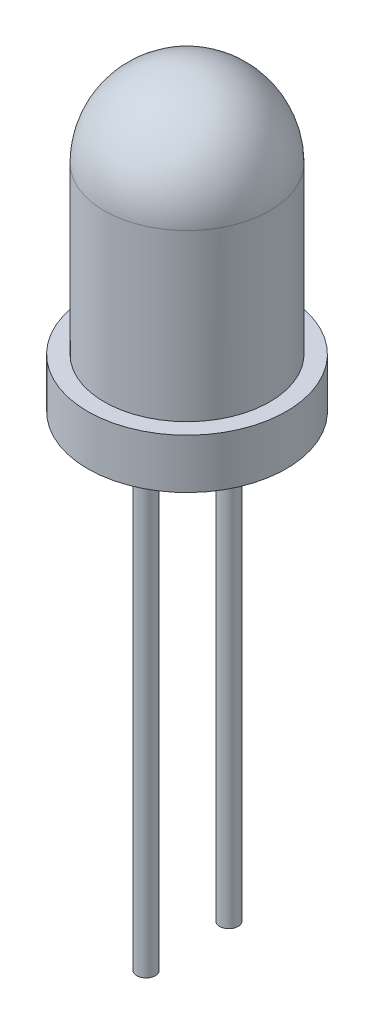
ISO-10303-21;
HEADER;
FILE_DESCRIPTION(('STEP AP214'),'2;1');
FILE_NAME('part.step','',(''),(''),'','','');
FILE_SCHEMA(('AUTOMOTIVE_DESIGN { 1 0 10303 214 1 1 1 1 }'));
ENDSEC;
DATA;
#1=APPLICATION_CONTEXT('core data for automotive mechanical design processes');
#2=APPLICATION_PROTOCOL_DEFINITION('international standard','automotive_design',2000,#1);
#3=PRODUCT_CONTEXT('',#1,'mechanical');
#4=PRODUCT('Part','Part','',(#3));
#5=PRODUCT_RELATED_PRODUCT_CATEGORY('part','',(#4));
#6=PRODUCT_DEFINITION_FORMATION('','',#4);
#7=PRODUCT_DEFINITION_CONTEXT('part definition',#1,'design');
#8=PRODUCT_DEFINITION('design','',#6,#7);
#9=PRODUCT_DEFINITION_SHAPE('','',#8);
#10=(LENGTH_UNIT() NAMED_UNIT(*) SI_UNIT(.MILLI.,.METRE.));
#11=(NAMED_UNIT(*) PLANE_ANGLE_UNIT() SI_UNIT($,.RADIAN.));
#12=(NAMED_UNIT(*) SI_UNIT($,.STERADIAN.) SOLID_ANGLE_UNIT());
#13=UNCERTAINTY_MEASURE_WITH_UNIT(LENGTH_MEASURE(1.E-05),#10,'distance_accuracy_value','');
#14=(GEOMETRIC_REPRESENTATION_CONTEXT(3) GLOBAL_UNCERTAINTY_ASSIGNED_CONTEXT((#13)) GLOBAL_UNIT_ASSIGNED_CONTEXT((#10,
#11,#12)) REPRESENTATION_CONTEXT('',''));
#15=CARTESIAN_POINT('',(0.,0.,0.));
#16=DIRECTION('',(0.,0.,1.));
#17=DIRECTION('',(1.,0.,0.));
#18=AXIS2_PLACEMENT_3D('',#15,#16,#17);
#19=CARTESIAN_POINT('',(-1.51810561215308,-0.0183654624054341,0.254));
#20=DIRECTION('',(0.,1.,0.));
#21=DIRECTION('',(0.,0.,1.));
#22=AXIS2_PLACEMENT_3D('',#19,#20,#21);
#23=PLANE('',#22);
#24=DIRECTION('',(0.,0.,-1.));
#25=VECTOR('',#24,1.);
#26=CARTESIAN_POINT('',(-1.51810561215308,-0.0183654624054341,0.254));
#27=LINE('',#26,#25);
#28=CARTESIAN_POINT('',(-1.51810561215308,-0.0183654624054341,0.254));
#29=VERTEX_POINT('',#28);
#30=CARTESIAN_POINT('',(-1.51810561215308,-0.0183654624054341,-0.254));
#31=VERTEX_POINT('',#30);
#32=EDGE_CURVE('E107',#29,#31,#27,.T.);
#33=ORIENTED_EDGE('',*,*,#32,.T.);
#34=DIRECTION('',(1.,0.,0.));
#35=VECTOR('',#34,1.);
#36=CARTESIAN_POINT('',(-1.51810561215308,-0.0183654624054341,-0.254));
#37=LINE('',#36,#35);
#38=CARTESIAN_POINT('',(-0.972005612152632,-0.0183654624054341,-0.254));
#39=VERTEX_POINT('',#38);
#40=EDGE_CURVE('E101',#31,#39,#37,.T.);
#41=ORIENTED_EDGE('',*,*,#40,.T.);
#42=DIRECTION('',(0.,0.,-1.));
#43=VECTOR('',#42,1.);
#44=CARTESIAN_POINT('',(-0.972005612152632,-0.0183654624054341,0.254));
#45=LINE('',#44,#43);
#46=CARTESIAN_POINT('',(-0.972005612152632,-0.0183654624054341,0.254));
#47=VERTEX_POINT('',#46);
#48=EDGE_CURVE('E12',#47,#39,#45,.T.);
#49=ORIENTED_EDGE('',*,*,#48,.F.);
#50=DIRECTION('',(1.,0.,0.));
#51=VECTOR('',#50,1.);
#52=CARTESIAN_POINT('',(-1.51810561215308,-0.0183654624054341,0.254));
#53=LINE('',#52,#51);
#54=EDGE_CURVE('E116',#29,#47,#53,.T.);
#55=ORIENTED_EDGE('',*,*,#54,.F.);
#56=EDGE_LOOP('',(#33,#41,#49,#55));
#57=FACE_BOUND('',#56,.T.);
#58=ADVANCED_FACE('F43',(#57),#23,.F.);
#59=CARTESIAN_POINT('',(-0.972005612152632,-0.0183654624054341,0.254));
#60=DIRECTION('',(-1.,0.,0.));
#61=DIRECTION('',(0.,-1.,0.));
#62=AXIS2_PLACEMENT_3D('',#59,#60,#61);
#63=PLANE('',#62);
#64=ORIENTED_EDGE('',*,*,#48,.T.);
#65=DIRECTION('',(0.,1.,0.));
#66=VECTOR('',#65,1.);
#67=CARTESIAN_POINT('',(-0.972005612152632,-0.0183654624054341,-0.254));
#68=LINE('',#67,#66);
#69=CARTESIAN_POINT('',(-0.97200561215264,2.52163453759334,-0.254));
#70=VERTEX_POINT('',#69);
#71=EDGE_CURVE('E91',#39,#70,#68,.T.);
#72=ORIENTED_EDGE('',*,*,#71,.T.);
#73=DIRECTION('',(0.,0.,-1.));
#74=VECTOR('',#73,1.);
#75=CARTESIAN_POINT('',(-0.97200561215264,2.52163453759334,0.254));
#76=LINE('',#75,#74);
#77=CARTESIAN_POINT('',(-0.97200561215264,2.52163453759334,0.254));
#78=VERTEX_POINT('',#77);
#79=EDGE_CURVE('E50',#78,#70,#76,.T.);
#80=ORIENTED_EDGE('',*,*,#79,.F.);
#81=DIRECTION('',(0.,1.,0.));
#82=VECTOR('',#81,1.);
#83=CARTESIAN_POINT('',(-0.972005612152632,-0.0183654624054341,0.254));
#84=LINE('',#83,#82);
#85=EDGE_CURVE('E92',#47,#78,#84,.T.);
#86=ORIENTED_EDGE('',*,*,#85,.F.);
#87=EDGE_LOOP('',(#64,#72,#80,#86));
#88=FACE_BOUND('',#87,.T.);
#89=ADVANCED_FACE('F89',(#88),#63,.F.);
#90=CARTESIAN_POINT('',(-1.24505561215268,4.04563453759452,0.254));
#91=DIRECTION('',(-0.984326018472931,-0.176358411642956,0.));
#92=DIRECTION('',(0.176358411642956,-0.984326018472931,0.));
#93=AXIS2_PLACEMENT_3D('',#90,#91,#92);
#94=PLANE('',#93);
#95=ORIENTED_EDGE('',*,*,#79,.T.);
#96=DIRECTION('',(-0.176358411642956,0.984326018472931,0.));
#97=VECTOR('',#96,1.);
#98=CARTESIAN_POINT('',(-1.24505561215268,4.04563453759452,-0.254));
#99=LINE('',#98,#97);
#100=CARTESIAN_POINT('',(-1.24505561215268,4.04563453759452,-0.254));
#101=VERTEX_POINT('',#100);
#102=EDGE_CURVE('E105',#70,#101,#99,.T.);
#103=ORIENTED_EDGE('',*,*,#102,.T.);
#104=DIRECTION('',(0.,0.,-1.));
#105=VECTOR('',#104,1.);
#106=CARTESIAN_POINT('',(-1.24505561215268,4.04563453759452,0.254));
#107=LINE('',#106,#105);
#108=CARTESIAN_POINT('',(-1.24505561215268,4.04563453759452,0.254));
#109=VERTEX_POINT('',#108);
#110=EDGE_CURVE('E126',#109,#101,#107,.T.);
#111=ORIENTED_EDGE('',*,*,#110,.F.);
#112=DIRECTION('',(-0.176358411642956,0.984326018472931,0.));
#113=VECTOR('',#112,1.);
#114=CARTESIAN_POINT('',(-1.24505561215268,4.04563453759452,0.254));
#115=LINE('',#114,#113);
#116=EDGE_CURVE('E119',#78,#109,#115,.T.);
#117=ORIENTED_EDGE('',*,*,#116,.F.);
#118=EDGE_LOOP('',(#95,#103,#111,#117));
#119=FACE_BOUND('',#118,.T.);
#120=ADVANCED_FACE('F129',(#119),#94,.F.);
#121=CARTESIAN_POINT('',(-1.24505561215268,4.04563453759452,0.254));
#122=DIRECTION('',(-1.6518150659341E-13,-1.,0.));
#123=DIRECTION('',(1.,-1.6518150659341E-13,0.));
#124=AXIS2_PLACEMENT_3D('',#121,#122,#123);
#125=PLANE('',#124);
#126=ORIENTED_EDGE('',*,*,#110,.T.);
#127=DIRECTION('',(-1.,1.6518150659341E-13,0.));
#128=VECTOR('',#127,1.);
#129=CARTESIAN_POINT('',(-1.24505561215268,4.04563453759452,-0.254));
#130=LINE('',#129,#128);
#131=CARTESIAN_POINT('',(-1.51810561215308,4.04563453759457,-0.254));
#132=VERTEX_POINT('',#131);
#133=EDGE_CURVE('E111',#101,#132,#130,.T.);
#134=ORIENTED_EDGE('',*,*,#133,.T.);
#135=DIRECTION('',(0.,0.,-1.));
#136=VECTOR('',#135,1.);
#137=CARTESIAN_POINT('',(-1.51810561215308,4.04563453759457,0.254));
#138=LINE('',#137,#136);
#139=CARTESIAN_POINT('',(-1.51810561215308,4.04563453759457,0.254));
#140=VERTEX_POINT('',#139);
#141=EDGE_CURVE('E124',#140,#132,#138,.T.);
#142=ORIENTED_EDGE('',*,*,#141,.F.);
#143=DIRECTION('',(-1.,1.6518150659341E-13,0.));
#144=VECTOR('',#143,1.);
#145=CARTESIAN_POINT('',(-1.24505561215268,4.04563453759452,0.254));
#146=LINE('',#145,#144);
#147=EDGE_CURVE('E62',#109,#140,#146,.T.);
#148=ORIENTED_EDGE('',*,*,#147,.F.);
#149=EDGE_LOOP('',(#126,#134,#142,#148));
#150=FACE_BOUND('',#149,.T.);
#151=ADVANCED_FACE('F140',(#150),#125,.F.);
#152=CARTESIAN_POINT('',(-1.51810561215308,-0.0183654624054341,0.254));
#153=DIRECTION('',(1.,0.,0.));
#154=DIRECTION('',(0.,0.,-1.));
#155=AXIS2_PLACEMENT_3D('',#152,#153,#154);
#156=PLANE('',#155);
#157=ORIENTED_EDGE('',*,*,#141,.T.);
#158=DIRECTION('',(0.,-1.,0.));
#159=VECTOR('',#158,1.);
#160=CARTESIAN_POINT('',(-1.51810561215308,-0.0183654624054341,-0.254));
#161=LINE('',#160,#159);
#162=EDGE_CURVE('E114',#132,#31,#161,.T.);
#163=ORIENTED_EDGE('',*,*,#162,.T.);
#164=ORIENTED_EDGE('',*,*,#32,.F.);
#165=DIRECTION('',(0.,-1.,0.));
#166=VECTOR('',#165,1.);
#167=CARTESIAN_POINT('',(-1.51810561215308,-0.0183654624054341,0.254));
#168=LINE('',#167,#166);
#169=EDGE_CURVE('E57',#140,#29,#168,.T.);
#170=ORIENTED_EDGE('',*,*,#169,.F.);
#171=EDGE_LOOP('',(#157,#163,#164,#170));
#172=FACE_BOUND('',#171,.T.);
#173=ADVANCED_FACE('F133',(#172),#156,.F.);
#174=CARTESIAN_POINT('',(-1.51810561215308,-0.0183654624054341,0.254));
#175=DIRECTION('',(0.,0.,1.));
#176=DIRECTION('',(1.,0.,0.));
#177=AXIS2_PLACEMENT_3D('',#174,#175,#176);
#178=PLANE('',#177);
#179=ORIENTED_EDGE('',*,*,#54,.T.);
#180=ORIENTED_EDGE('',*,*,#85,.T.);
#181=ORIENTED_EDGE('',*,*,#116,.T.);
#182=ORIENTED_EDGE('',*,*,#147,.T.);
#183=ORIENTED_EDGE('',*,*,#169,.T.);
#184=EDGE_LOOP('',(#179,#180,#181,#182,#183));
#185=FACE_BOUND('',#184,.T.);
#186=ADVANCED_FACE('F131',(#185),#178,.T.);
#187=CARTESIAN_POINT('',(-1.51810561215308,-0.0183654624054341,-0.254));
#188=DIRECTION('',(0.,0.,1.));
#189=DIRECTION('',(1.,0.,0.));
#190=AXIS2_PLACEMENT_3D('',#187,#188,#189);
#191=PLANE('',#190);
#192=ORIENTED_EDGE('',*,*,#40,.F.);
#193=ORIENTED_EDGE('',*,*,#162,.F.);
#194=ORIENTED_EDGE('',*,*,#133,.F.);
#195=ORIENTED_EDGE('',*,*,#102,.F.);
#196=ORIENTED_EDGE('',*,*,#71,.F.);
#197=EDGE_LOOP('',(#192,#193,#194,#195,#196));
#198=FACE_BOUND('',#197,.T.);
#199=ADVANCED_FACE('F99',(#198),#191,.F.);
#200=CLOSED_SHELL('',(#58,#89,#120,#151,#173,#186,#199));
#201=MANIFOLD_SOLID_BREP('B2',#200);
#202=CARTESIAN_POINT('',(0.983794387847156,-0.0183654624053667,0.254));
#203=DIRECTION('',(0.,1.,0.));
#204=DIRECTION('',(0.,0.,1.));
#205=AXIS2_PLACEMENT_3D('',#202,#203,#204);
#206=PLANE('',#205);
#207=DIRECTION('',(0.,0.,-1.));
#208=VECTOR('',#207,1.);
#209=CARTESIAN_POINT('',(0.983794387847156,-0.0183654624053667,0.254));
#210=LINE('',#209,#208);
#211=CARTESIAN_POINT('',(0.983794387847156,-0.0183654624053667,0.254));
#212=VERTEX_POINT('',#211);
#213=CARTESIAN_POINT('',(0.983794387847156,-0.0183654624053667,-0.254));
#214=VERTEX_POINT('',#213);
#215=EDGE_CURVE('E281',#212,#214,#210,.T.);
#216=ORIENTED_EDGE('',*,*,#215,.T.);
#217=DIRECTION('',(1.,0.,0.));
#218=VECTOR('',#217,1.);
#219=CARTESIAN_POINT('',(0.983794387847156,-0.0183654624053667,-0.254));
#220=LINE('',#219,#218);
#221=CARTESIAN_POINT('',(1.52989438784706,-0.0183654624053667,-0.254));
#222=VERTEX_POINT('',#221);
#223=EDGE_CURVE('E275',#214,#222,#220,.T.);
#224=ORIENTED_EDGE('',*,*,#223,.T.);
#225=DIRECTION('',(0.,0.,-1.));
#226=VECTOR('',#225,1.);
#227=CARTESIAN_POINT('',(1.52989438784706,-0.0183654624053667,0.254));
#228=LINE('',#227,#226);
#229=CARTESIAN_POINT('',(1.52989438784706,-0.0183654624053667,0.254));
#230=VERTEX_POINT('',#229);
#231=EDGE_CURVE('E41',#230,#222,#228,.T.);
#232=ORIENTED_EDGE('',*,*,#231,.F.);
#233=DIRECTION('',(1.,0.,0.));
#234=VECTOR('',#233,1.);
#235=CARTESIAN_POINT('',(0.983794387847156,-0.0183654624053667,0.254));
#236=LINE('',#235,#234);
#237=EDGE_CURVE('E299',#212,#230,#236,.T.);
#238=ORIENTED_EDGE('',*,*,#237,.F.);
#239=EDGE_LOOP('',(#216,#224,#232,#238));
#240=FACE_BOUND('',#239,.T.);
#241=ADVANCED_FACE('F199',(#240),#206,.F.);
#242=CARTESIAN_POINT('',(1.52989438784706,-0.0183654624053667,0.254));
#243=DIRECTION('',(-1.,0.,0.));
#244=DIRECTION('',(0.,-1.,0.));
#245=AXIS2_PLACEMENT_3D('',#242,#243,#244);
#246=PLANE('',#245);
#247=ORIENTED_EDGE('',*,*,#231,.T.);
#248=DIRECTION('',(0.,1.,0.));
#249=VECTOR('',#248,1.);
#250=CARTESIAN_POINT('',(1.52989438784706,-0.0183654624053667,-0.254));
#251=LINE('',#250,#249);
#252=CARTESIAN_POINT('',(1.52989438784706,3.79163453759448,-0.254));
#253=VERTEX_POINT('',#252);
#254=EDGE_CURVE('E265',#222,#253,#251,.T.);
#255=ORIENTED_EDGE('',*,*,#254,.T.);
#256=DIRECTION('',(0.,0.,-1.));
#257=VECTOR('',#256,1.);
#258=CARTESIAN_POINT('',(1.52989438784706,3.79163453759448,0.254));
#259=LINE('',#258,#257);
#260=CARTESIAN_POINT('',(1.52989438784706,3.79163453759448,0.254));
#261=VERTEX_POINT('',#260);
#262=EDGE_CURVE('E206',#261,#253,#259,.T.);
#263=ORIENTED_EDGE('',*,*,#262,.F.);
#264=DIRECTION('',(0.,1.,0.));
#265=VECTOR('',#264,1.);
#266=CARTESIAN_POINT('',(1.52989438784706,-0.0183654624053667,0.254));
#267=LINE('',#266,#265);
#268=EDGE_CURVE('E266',#230,#261,#267,.T.);
#269=ORIENTED_EDGE('',*,*,#268,.F.);
#270=EDGE_LOOP('',(#247,#255,#263,#269));
#271=FACE_BOUND('',#270,.T.);
#272=ADVANCED_FACE('F263',(#271),#246,.F.);
#273=CARTESIAN_POINT('',(1.27589438784708,3.79163453759448,0.254));
#274=DIRECTION('',(0.,0.,-1.));
#275=DIRECTION('',(-1.,0.,0.));
#276=AXIS2_PLACEMENT_3D('',#273,#274,#275);
#277=CYLINDRICAL_SURFACE('',#276,0.253999999999972);
#278=ORIENTED_EDGE('',*,*,#262,.T.);
#279=CARTESIAN_POINT('',(1.27589438784708,3.79163453759448,-0.254));
#280=DIRECTION('',(0.,0.,1.));
#281=DIRECTION('',(1.,0.,0.));
#282=AXIS2_PLACEMENT_3D('',#279,#280,#281);
#283=CIRCLE('',#282,0.253999999999972);
#284=CARTESIAN_POINT('',(1.27589438784708,4.04563453759448,-0.254));
#285=VERTEX_POINT('',#284);
#286=EDGE_CURVE('E279',#253,#285,#283,.T.);
#287=ORIENTED_EDGE('',*,*,#286,.T.);
#288=DIRECTION('',(0.,0.,-1.));
#289=VECTOR('',#288,1.);
#290=CARTESIAN_POINT('',(1.27589438784708,4.04563453759448,0.254));
#291=LINE('',#290,#289);
#292=CARTESIAN_POINT('',(1.27589438784708,4.04563453759448,0.254));
#293=VERTEX_POINT('',#292);
#294=EDGE_CURVE('E321',#293,#285,#291,.T.);
#295=ORIENTED_EDGE('',*,*,#294,.F.);
#296=CARTESIAN_POINT('',(1.27589438784708,3.79163453759448,0.254));
#297=DIRECTION('',(0.,0.,1.));
#298=DIRECTION('',(1.,0.,0.));
#299=AXIS2_PLACEMENT_3D('',#296,#297,#298);
#300=CIRCLE('',#299,0.253999999999972);
#301=EDGE_CURVE('E302',#261,#293,#300,.T.);
#302=ORIENTED_EDGE('',*,*,#301,.F.);
#303=EDGE_LOOP('',(#278,#287,#295,#302));
#304=FACE_BOUND('',#303,.T.);
#305=ADVANCED_FACE('F324',(#304),#277,.T.);
#306=CARTESIAN_POINT('',(1.27589438784708,4.04563453759448,0.254));
#307=DIRECTION('',(0.,-1.,0.));
#308=DIRECTION('',(0.,0.,-1.));
#309=AXIS2_PLACEMENT_3D('',#306,#307,#308);
#310=PLANE('',#309);
#311=ORIENTED_EDGE('',*,*,#294,.T.);
#312=DIRECTION('',(-1.,0.,0.));
#313=VECTOR('',#312,1.);
#314=CARTESIAN_POINT('',(1.27589438784708,4.04563453759448,-0.254));
#315=LINE('',#314,#313);
#316=CARTESIAN_POINT('',(-0.737055612152962,4.04563453759448,-0.254));
#317=VERTEX_POINT('',#316);
#318=EDGE_CURVE('E285',#285,#317,#315,.T.);
#319=ORIENTED_EDGE('',*,*,#318,.T.);
#320=DIRECTION('',(0.,0.,-1.));
#321=VECTOR('',#320,1.);
#322=CARTESIAN_POINT('',(-0.737055612152962,4.04563453759448,0.254));
#323=LINE('',#322,#321);
#324=CARTESIAN_POINT('',(-0.737055612152962,4.04563453759448,0.254));
#325=VERTEX_POINT('',#324);
#326=EDGE_CURVE('E319',#325,#317,#323,.T.);
#327=ORIENTED_EDGE('',*,*,#326,.F.);
#328=DIRECTION('',(-1.,0.,0.));
#329=VECTOR('',#328,1.);
#330=CARTESIAN_POINT('',(1.27589438784708,4.04563453759448,0.254));
#331=LINE('',#330,#329);
#332=EDGE_CURVE('E304',#293,#325,#331,.T.);
#333=ORIENTED_EDGE('',*,*,#332,.F.);
#334=EDGE_LOOP('',(#311,#319,#327,#333));
#335=FACE_BOUND('',#334,.T.);
#336=ADVANCED_FACE('F332',(#335),#310,.F.);
#337=CARTESIAN_POINT('',(-0.737055612152962,4.04563453759448,0.254));
#338=DIRECTION('',(0.984326018472887,0.176358411643205,0.));
#339=DIRECTION('',(-0.176358411643205,0.984326018472887,0.));
#340=AXIS2_PLACEMENT_3D('',#337,#338,#339);
#341=PLANE('',#340);
#342=ORIENTED_EDGE('',*,*,#326,.T.);
#343=DIRECTION('',(0.176358411643205,-0.984326018472887,0.));
#344=VECTOR('',#343,1.);
#345=CARTESIAN_POINT('',(-0.737055612152962,4.04563453759448,-0.254));
#346=LINE('',#345,#344);
#347=CARTESIAN_POINT('',(-0.464005612152741,2.52163453759451,-0.254));
#348=VERTEX_POINT('',#347);
#349=EDGE_CURVE('E288',#317,#348,#346,.T.);
#350=ORIENTED_EDGE('',*,*,#349,.T.);
#351=DIRECTION('',(0.,0.,-1.));
#352=VECTOR('',#351,1.);
#353=CARTESIAN_POINT('',(-0.464005612152741,2.52163453759451,0.254));
#354=LINE('',#353,#352);
#355=CARTESIAN_POINT('',(-0.464005612152741,2.52163453759451,0.254));
#356=VERTEX_POINT('',#355);
#357=EDGE_CURVE('E317',#356,#348,#354,.T.);
#358=ORIENTED_EDGE('',*,*,#357,.F.);
#359=DIRECTION('',(0.176358411643205,-0.984326018472887,0.));
#360=VECTOR('',#359,1.);
#361=CARTESIAN_POINT('',(-0.737055612152962,4.04563453759448,0.254));
#362=LINE('',#361,#360);
#363=EDGE_CURVE('E306',#325,#356,#362,.T.);
#364=ORIENTED_EDGE('',*,*,#363,.F.);
#365=EDGE_LOOP('',(#342,#350,#358,#364));
#366=FACE_BOUND('',#365,.T.);
#367=ADVANCED_FACE('F335',(#366),#341,.F.);
#368=CARTESIAN_POINT('',(0.729794387847184,2.52163453759447,0.254));
#369=DIRECTION('',(0.,1.,0.));
#370=DIRECTION('',(0.,0.,1.));
#371=AXIS2_PLACEMENT_3D('',#368,#369,#370);
#372=PLANE('',#371);
#373=ORIENTED_EDGE('',*,*,#357,.T.);
#374=DIRECTION('',(1.,0.,0.));
#375=VECTOR('',#374,1.);
#376=CARTESIAN_POINT('',(0.475794387847054,2.52163453759447,-0.254));
#377=LINE('',#376,#375);
#378=CARTESIAN_POINT('',(0.729794387847184,2.52163453759449,-0.254));
#379=VERTEX_POINT('',#378);
#380=EDGE_CURVE('E291',#348,#379,#377,.T.);
#381=ORIENTED_EDGE('',*,*,#380,.T.);
#382=DIRECTION('',(0.,0.,-1.));
#383=VECTOR('',#382,1.);
#384=CARTESIAN_POINT('',(0.729794387847184,2.52163453759449,0.254));
#385=LINE('',#384,#383);
#386=CARTESIAN_POINT('',(0.729794387847184,2.52163453759449,0.254));
#387=VERTEX_POINT('',#386);
#388=EDGE_CURVE('E315',#387,#379,#385,.T.);
#389=ORIENTED_EDGE('',*,*,#388,.F.);
#390=DIRECTION('',(1.,0.,0.));
#391=VECTOR('',#390,1.);
#392=CARTESIAN_POINT('',(0.475794387847054,2.52163453759447,0.254));
#393=LINE('',#392,#391);
#394=EDGE_CURVE('E308',#356,#387,#393,.T.);
#395=ORIENTED_EDGE('',*,*,#394,.F.);
#396=EDGE_LOOP('',(#373,#381,#389,#395));
#397=FACE_BOUND('',#396,.T.);
#398=ADVANCED_FACE('F340',(#397),#372,.F.);
#399=CARTESIAN_POINT('',(0.729794387847184,2.26763453759454,0.254));
#400=DIRECTION('',(0.,0.,-1.));
#401=DIRECTION('',(-1.,0.,0.));
#402=AXIS2_PLACEMENT_3D('',#399,#400,#401);
#403=CYLINDRICAL_SURFACE('',#402,0.253999999999949);
#404=ORIENTED_EDGE('',*,*,#388,.T.);
#405=CARTESIAN_POINT('',(0.729794387847184,2.26763453759454,-0.254));
#406=DIRECTION('',(0.,0.,-1.));
#407=DIRECTION('',(1.,0.,0.));
#408=AXIS2_PLACEMENT_3D('',#405,#406,#407);
#409=CIRCLE('',#408,0.253999999999949);
#410=CARTESIAN_POINT('',(0.983794387847156,2.26763453759454,-0.254));
#411=VERTEX_POINT('',#410);
#412=EDGE_CURVE('E294',#379,#411,#409,.T.);
#413=ORIENTED_EDGE('',*,*,#412,.T.);
#414=DIRECTION('',(0.,0.,-1.));
#415=VECTOR('',#414,1.);
#416=CARTESIAN_POINT('',(0.983794387847156,2.26763453759454,0.254));
#417=LINE('',#416,#415);
#418=CARTESIAN_POINT('',(0.983794387847156,2.26763453759454,0.254));
#419=VERTEX_POINT('',#418);
#420=EDGE_CURVE('E313',#419,#411,#417,.T.);
#421=ORIENTED_EDGE('',*,*,#420,.F.);
#422=CARTESIAN_POINT('',(0.729794387847184,2.26763453759454,0.254));
#423=DIRECTION('',(0.,0.,-1.));
#424=DIRECTION('',(1.,0.,0.));
#425=AXIS2_PLACEMENT_3D('',#422,#423,#424);
#426=CIRCLE('',#425,0.253999999999949);
#427=EDGE_CURVE('E218',#387,#419,#426,.T.);
#428=ORIENTED_EDGE('',*,*,#427,.F.);
#429=EDGE_LOOP('',(#404,#413,#421,#428));
#430=FACE_BOUND('',#429,.T.);
#431=ADVANCED_FACE('F343',(#430),#403,.F.);
#432=CARTESIAN_POINT('',(0.983794387847156,-0.0183654624053667,0.254));
#433=DIRECTION('',(1.,0.,0.));
#434=DIRECTION('',(0.,0.,-1.));
#435=AXIS2_PLACEMENT_3D('',#432,#433,#434);
#436=PLANE('',#435);
#437=ORIENTED_EDGE('',*,*,#420,.T.);
#438=DIRECTION('',(0.,-1.,0.));
#439=VECTOR('',#438,1.);
#440=CARTESIAN_POINT('',(0.983794387847156,-0.0183654624053667,-0.254));
#441=LINE('',#440,#439);
#442=EDGE_CURVE('E297',#411,#214,#441,.T.);
#443=ORIENTED_EDGE('',*,*,#442,.T.);
#444=ORIENTED_EDGE('',*,*,#215,.F.);
#445=DIRECTION('',(0.,-1.,0.));
#446=VECTOR('',#445,1.);
#447=CARTESIAN_POINT('',(0.983794387847156,-0.0183654624053667,0.254));
#448=LINE('',#447,#446);
#449=EDGE_CURVE('E213',#419,#212,#448,.T.);
#450=ORIENTED_EDGE('',*,*,#449,.F.);
#451=EDGE_LOOP('',(#437,#443,#444,#450));
#452=FACE_BOUND('',#451,.T.);
#453=ADVANCED_FACE('F345',(#452),#436,.F.);
#454=CARTESIAN_POINT('',(1.27589438784708,3.79163453759448,0.254));
#455=DIRECTION('',(0.,0.,1.));
#456=DIRECTION('',(1.,0.,0.));
#457=AXIS2_PLACEMENT_3D('',#454,#455,#456);
#458=PLANE('',#457);
#459=ORIENTED_EDGE('',*,*,#237,.T.);
#460=ORIENTED_EDGE('',*,*,#268,.T.);
#461=ORIENTED_EDGE('',*,*,#301,.T.);
#462=ORIENTED_EDGE('',*,*,#332,.T.);
#463=ORIENTED_EDGE('',*,*,#363,.T.);
#464=ORIENTED_EDGE('',*,*,#394,.T.);
#465=ORIENTED_EDGE('',*,*,#427,.T.);
#466=ORIENTED_EDGE('',*,*,#449,.T.);
#467=EDGE_LOOP('',(#459,#460,#461,#462,#463,#464,#465,#466));
#468=FACE_BOUND('',#467,.T.);
#469=ADVANCED_FACE('F327',(#468),#458,.T.);
#470=CARTESIAN_POINT('',(1.27589438784708,3.79163453759448,-0.254));
#471=DIRECTION('',(0.,0.,1.));
#472=DIRECTION('',(1.,0.,0.));
#473=AXIS2_PLACEMENT_3D('',#470,#471,#472);
#474=PLANE('',#473);
#475=ORIENTED_EDGE('',*,*,#223,.F.);
#476=ORIENTED_EDGE('',*,*,#442,.F.);
#477=ORIENTED_EDGE('',*,*,#412,.F.);
#478=ORIENTED_EDGE('',*,*,#380,.F.);
#479=ORIENTED_EDGE('',*,*,#349,.F.);
#480=ORIENTED_EDGE('',*,*,#318,.F.);
#481=ORIENTED_EDGE('',*,*,#286,.F.);
#482=ORIENTED_EDGE('',*,*,#254,.F.);
#483=EDGE_LOOP('',(#475,#476,#477,#478,#479,#480,#481,#482));
#484=FACE_BOUND('',#483,.T.);
#485=ADVANCED_FACE('F273',(#484),#474,.F.);
#486=CLOSED_SHELL('',(#241,#272,#305,#336,#367,#398,#431,#453,#469,#485));
#487=MANIFOLD_SOLID_BREP('B6',#486);
#488=CARTESIAN_POINT('',(1.25095,-15.1136706809318,0.));
#489=DIRECTION('',(0.,1.,0.));
#490=DIRECTION('',(0.,0.,1.));
#491=AXIS2_PLACEMENT_3D('',#488,#489,#490);
#492=CYLINDRICAL_SURFACE('',#491,0.153);
#493=CARTESIAN_POINT('',(1.25095,0.253329319068173,0.));
#494=DIRECTION('',(0.,-1.,0.));
#495=DIRECTION('',(0.,0.,-1.));
#496=AXIS2_PLACEMENT_3D('',#493,#494,#495);
#497=CIRCLE('',#496,0.153);
#498=CARTESIAN_POINT('',(1.25095,0.253329319068173,-0.153));
#499=VERTEX_POINT('',#498);
#500=EDGE_CURVE('E198',#499,#499,#497,.T.);
#501=ORIENTED_EDGE('',*,*,#500,.F.);
#502=EDGE_LOOP('',(#501));
#503=FACE_BOUND('',#502,.T.);
#504=CARTESIAN_POINT('',(1.25095,-12.5736706809318,0.));
#505=DIRECTION('',(0.,-1.,0.));
#506=DIRECTION('',(0.,0.,-1.));
#507=AXIS2_PLACEMENT_3D('',#504,#505,#506);
#508=CIRCLE('',#507,0.153);
#509=CARTESIAN_POINT('',(1.25095,-12.5736706809318,-0.153));
#510=VERTEX_POINT('',#509);
#511=EDGE_CURVE('E432',#510,#510,#508,.T.);
#512=ORIENTED_EDGE('',*,*,#511,.T.);
#513=EDGE_LOOP('',(#512));
#514=FACE_BOUND('',#513,.T.);
#515=ADVANCED_FACE('F429',(#503,#514),#492,.F.);
#516=CARTESIAN_POINT('',(2.98604921992118,0.253329319068173,0.));
#517=DIRECTION('',(0.,-1.,0.));
#518=DIRECTION('',(0.,0.,-1.));
#519=AXIS2_PLACEMENT_3D('',#516,#517,#518);
#520=PLANE('',#519);
#521=CARTESIAN_POINT('',(-1.25095,0.253329319068173,0.));
#522=DIRECTION('',(0.,-1.,0.));
#523=DIRECTION('',(0.,0.,-1.));
#524=AXIS2_PLACEMENT_3D('',#521,#522,#523);
#525=CIRCLE('',#524,0.153);
#526=CARTESIAN_POINT('',(-1.25095,0.253329319068173,-0.153));
#527=VERTEX_POINT('',#526);
#528=EDGE_CURVE('E441',#527,#527,#525,.T.);
#529=ORIENTED_EDGE('',*,*,#528,.T.);
#530=EDGE_LOOP('',(#529));
#531=FACE_BOUND('',#530,.T.);
#532=CARTESIAN_POINT('',(-0.0139507800788188,0.253329319068173,0.));
#533=DIRECTION('',(0.,-1.,0.));
#534=DIRECTION('',(0.,0.,-1.));
#535=AXIS2_PLACEMENT_3D('',#532,#533,#534);
#536=CIRCLE('',#535,2.6444);
#537=CARTESIAN_POINT('',(-0.0139507800788188,0.253329319068173,-2.6444));
#538=VERTEX_POINT('',#537);
#539=EDGE_CURVE('E457',#538,#538,#536,.T.);
#540=ORIENTED_EDGE('',*,*,#539,.F.);
#541=EDGE_LOOP('',(#540));
#542=FACE_BOUND('',#541,.T.);
#543=ORIENTED_EDGE('',*,*,#500,.T.);
#544=EDGE_LOOP('',(#543));
#545=FACE_BOUND('',#544,.T.);
#546=ADVANCED_FACE('F507',(#531,#542,#545),#520,.F.);
#547=CARTESIAN_POINT('',(-0.0139507800788188,-0.240891713292975,0.));
#548=DIRECTION('',(0.,-1.,0.));
#549=DIRECTION('',(0.,0.,-1.));
#550=AXIS2_PLACEMENT_3D('',#547,#548,#549);
#551=CYLINDRICAL_SURFACE('',#550,2.6444);
#552=CARTESIAN_POINT('',(-0.0139507800788188,1.49932931906817,0.));
#553=DIRECTION('',(0.,1.,0.));
#554=DIRECTION('',(0.,0.,1.));
#555=AXIS2_PLACEMENT_3D('',#552,#553,#554);
#556=CIRCLE('',#555,2.6444);
#557=CARTESIAN_POINT('',(-0.0139507800788188,1.49932931906817,2.6444));
#558=VERTEX_POINT('',#557);
#559=EDGE_CURVE('E455',#558,#558,#556,.F.);
#560=ORIENTED_EDGE('',*,*,#559,.F.);
#561=EDGE_LOOP('',(#560));
#562=FACE_BOUND('',#561,.T.);
#563=ORIENTED_EDGE('',*,*,#539,.T.);
#564=EDGE_LOOP('',(#563));
#565=FACE_BOUND('',#564,.T.);
#566=ADVANCED_FACE('F512',(#562,#565),#551,.F.);
#567=CARTESIAN_POINT('',(2.98604921992118,1.49932931906817,0.));
#568=DIRECTION('',(0.,1.,0.));
#569=DIRECTION('',(0.,0.,1.));
#570=AXIS2_PLACEMENT_3D('',#567,#568,#569);
#571=PLANE('',#570);
#572=CARTESIAN_POINT('',(-0.0139507800788188,1.49932931906817,0.));
#573=DIRECTION('',(0.,1.,0.));
#574=DIRECTION('',(0.,0.,1.));
#575=AXIS2_PLACEMENT_3D('',#572,#573,#574);
#576=CIRCLE('',#575,2.373);
#577=CARTESIAN_POINT('',(-0.0139507800788188,1.49932931906817,2.373));
#578=VERTEX_POINT('',#577);
#579=EDGE_CURVE('E452',#578,#578,#576,.F.);
#580=ORIENTED_EDGE('',*,*,#579,.F.);
#581=EDGE_LOOP('',(#580));
#582=FACE_BOUND('',#581,.T.);
#583=ORIENTED_EDGE('',*,*,#559,.T.);
#584=EDGE_LOOP('',(#583));
#585=FACE_BOUND('',#584,.T.);
#586=ADVANCED_FACE('F518',(#582,#585),#571,.F.);
#587=CARTESIAN_POINT('',(-0.0139507800788188,-0.240891713292975,0.));
#588=DIRECTION('',(0.,-1.,0.));
#589=DIRECTION('',(0.,0.,-1.));
#590=AXIS2_PLACEMENT_3D('',#587,#588,#589);
#591=CYLINDRICAL_SURFACE('',#590,2.373);
#592=CARTESIAN_POINT('',(-0.0139507800788188,6.62632931906817,0.));
#593=DIRECTION('',(0.,-1.,0.));
#594=DIRECTION('',(0.,0.,-1.));
#595=AXIS2_PLACEMENT_3D('',#592,#593,#594);
#596=CIRCLE('',#595,2.373);
#597=CARTESIAN_POINT('',(-0.0139507800788188,6.62632931906817,-2.373));
#598=VERTEX_POINT('',#597);
#599=EDGE_CURVE('E449',#598,#598,#596,.T.);
#600=ORIENTED_EDGE('',*,*,#599,.F.);
#601=EDGE_LOOP('',(#600));
#602=FACE_BOUND('',#601,.T.);
#603=ORIENTED_EDGE('',*,*,#579,.T.);
#604=EDGE_LOOP('',(#603));
#605=FACE_BOUND('',#604,.T.);
#606=ADVANCED_FACE('F528',(#602,#605),#591,.F.);
#607=CARTESIAN_POINT('',(-0.0139507800788195,6.62632931906817,0.));
#608=DIRECTION('',(0.,-1.,0.));
#609=DIRECTION('',(1.,0.,0.));
#610=AXIS2_PLACEMENT_3D('',#607,#608,#609);
#611=SPHERICAL_SURFACE('',#610,2.373);
#612=ORIENTED_EDGE('',*,*,#599,.T.);
#613=EDGE_LOOP('',(#612));
#614=FACE_BOUND('',#613,.T.);
#615=ADVANCED_FACE('F532',(#614),#611,.F.);
#616=CARTESIAN_POINT('',(-1.25095,-15.1136706809318,0.));
#617=DIRECTION('',(0.,1.,0.));
#618=DIRECTION('',(0.,0.,1.));
#619=AXIS2_PLACEMENT_3D('',#616,#617,#618);
#620=CYLINDRICAL_SURFACE('',#619,0.153);
#621=CARTESIAN_POINT('',(-1.25095,-14.9866706809318,0.));
#622=DIRECTION('',(0.,-1.,0.));
#623=DIRECTION('',(0.,0.,-1.));
#624=AXIS2_PLACEMENT_3D('',#621,#622,#623);
#625=CIRCLE('',#624,0.153);
#626=CARTESIAN_POINT('',(-1.25095,-14.9866706809318,-0.153));
#627=VERTEX_POINT('',#626);
#628=EDGE_CURVE('E436',#627,#627,#625,.T.);
#629=ORIENTED_EDGE('',*,*,#628,.T.);
#630=EDGE_LOOP('',(#629));
#631=FACE_BOUND('',#630,.T.);
#632=ORIENTED_EDGE('',*,*,#528,.F.);
#633=EDGE_LOOP('',(#632));
#634=FACE_BOUND('',#633,.T.);
#635=ADVANCED_FACE('F504',(#631,#634),#620,.F.);
#636=CARTESIAN_POINT('',(-1.25095,-14.9866706809318,0.));
#637=DIRECTION('',(0.,-1.,0.));
#638=DIRECTION('',(0.,0.,-1.));
#639=AXIS2_PLACEMENT_3D('',#636,#637,#638);
#640=PLANE('',#639);
#641=ORIENTED_EDGE('',*,*,#628,.F.);
#642=EDGE_LOOP('',(#641));
#643=FACE_BOUND('',#642,.T.);
#644=ADVANCED_FACE('F495',(#643),#640,.F.);
#645=CARTESIAN_POINT('',(1.25095,-12.5736706809318,0.));
#646=DIRECTION('',(0.,-1.,0.));
#647=DIRECTION('',(0.,0.,-1.));
#648=AXIS2_PLACEMENT_3D('',#645,#646,#647);
#649=PLANE('',#648);
#650=ORIENTED_EDGE('',*,*,#511,.F.);
#651=EDGE_LOOP('',(#650));
#652=FACE_BOUND('',#651,.T.);
#653=CARTESIAN_POINT('',(1.25095,-12.5736706809318,0.));
#654=DIRECTION('',(0.,-1.,0.));
#655=DIRECTION('',(0.,0.,-1.));
#656=AXIS2_PLACEMENT_3D('',#653,#654,#655);
#657=CIRCLE('',#656,0.28);
#658=CARTESIAN_POINT('',(1.25095,-12.5736706809318,-0.28));
#659=VERTEX_POINT('',#658);
#660=EDGE_CURVE('E484',#659,#659,#657,.T.);
#661=ORIENTED_EDGE('',*,*,#660,.T.);
#662=EDGE_LOOP('',(#661));
#663=FACE_BOUND('',#662,.T.);
#664=ADVANCED_FACE('F492',(#652,#663),#649,.T.);
#665=CARTESIAN_POINT('',(1.25095,-15.1136706809318,0.));
#666=DIRECTION('',(0.,1.,0.));
#667=DIRECTION('',(0.,0.,1.));
#668=AXIS2_PLACEMENT_3D('',#665,#666,#667);
#669=CYLINDRICAL_SURFACE('',#668,0.28);
#670=CARTESIAN_POINT('',(1.25095,0.126329319068173,0.));
#671=DIRECTION('',(0.,-1.,0.));
#672=DIRECTION('',(0.,0.,-1.));
#673=AXIS2_PLACEMENT_3D('',#670,#671,#672);
#674=CIRCLE('',#673,0.28);
#675=CARTESIAN_POINT('',(1.25095,0.126329319068173,-0.28));
#676=VERTEX_POINT('',#675);
#677=EDGE_CURVE('E481',#676,#676,#674,.T.);
#678=ORIENTED_EDGE('',*,*,#677,.T.);
#679=EDGE_LOOP('',(#678));
#680=FACE_BOUND('',#679,.T.);
#681=ORIENTED_EDGE('',*,*,#660,.F.);
#682=EDGE_LOOP('',(#681));
#683=FACE_BOUND('',#682,.T.);
#684=ADVANCED_FACE('F494',(#680,#683),#669,.T.);
#685=CARTESIAN_POINT('',(2.98604921992118,0.126329319068173,0.));
#686=DIRECTION('',(0.,-1.,0.));
#687=DIRECTION('',(0.,0.,-1.));
#688=AXIS2_PLACEMENT_3D('',#685,#686,#687);
#689=PLANE('',#688);
#690=CARTESIAN_POINT('',(-1.25095,0.126329319068173,0.));
#691=DIRECTION('',(0.,-1.,0.));
#692=DIRECTION('',(0.,0.,-1.));
#693=AXIS2_PLACEMENT_3D('',#690,#691,#692);
#694=CIRCLE('',#693,0.28);
#695=CARTESIAN_POINT('',(-1.25095,0.126329319068173,-0.28));
#696=VERTEX_POINT('',#695);
#697=EDGE_CURVE('E478',#696,#696,#694,.T.);
#698=ORIENTED_EDGE('',*,*,#697,.F.);
#699=EDGE_LOOP('',(#698));
#700=FACE_BOUND('',#699,.T.);
#701=CARTESIAN_POINT('',(-0.0139507800788188,0.126329319068173,0.));
#702=DIRECTION('',(0.,-1.,0.));
#703=DIRECTION('',(0.,0.,-1.));
#704=AXIS2_PLACEMENT_3D('',#701,#702,#703);
#705=CIRCLE('',#704,3.);
#706=CARTESIAN_POINT('',(-0.0139507800788188,0.126329319068173,-3.));
#707=VERTEX_POINT('',#706);
#708=EDGE_CURVE('E470',#707,#707,#705,.T.);
#709=ORIENTED_EDGE('',*,*,#708,.T.);
#710=EDGE_LOOP('',(#709));
#711=FACE_BOUND('',#710,.T.);
#712=ORIENTED_EDGE('',*,*,#677,.F.);
#713=EDGE_LOOP('',(#712));
#714=FACE_BOUND('',#713,.T.);
#715=ADVANCED_FACE('F501',(#700,#711,#714),#689,.T.);
#716=CARTESIAN_POINT('',(-0.0139507800788188,-0.240891713292975,0.));
#717=DIRECTION('',(0.,-1.,0.));
#718=DIRECTION('',(0.,0.,-1.));
#719=AXIS2_PLACEMENT_3D('',#716,#717,#718);
#720=CYLINDRICAL_SURFACE('',#719,3.);
#721=CARTESIAN_POINT('',(-0.0139507800788188,1.62632931906817,0.));
#722=DIRECTION('',(0.,-1.,0.));
#723=DIRECTION('',(0.,0.,-1.));
#724=AXIS2_PLACEMENT_3D('',#721,#722,#723);
#725=CIRCLE('',#724,3.);
#726=CARTESIAN_POINT('',(-0.0139507800788188,1.62632931906817,-3.));
#727=VERTEX_POINT('',#726);
#728=EDGE_CURVE('E444',#727,#727,#725,.T.);
#729=ORIENTED_EDGE('',*,*,#728,.T.);
#730=EDGE_LOOP('',(#729));
#731=FACE_BOUND('',#730,.T.);
#732=ORIENTED_EDGE('',*,*,#708,.F.);
#733=EDGE_LOOP('',(#732));
#734=FACE_BOUND('',#733,.T.);
#735=ADVANCED_FACE('F523',(#731,#734),#720,.T.);
#736=CARTESIAN_POINT('',(2.98604921992118,1.62632931906817,0.));
#737=DIRECTION('',(0.,1.,0.));
#738=DIRECTION('',(0.,0.,1.));
#739=AXIS2_PLACEMENT_3D('',#736,#737,#738);
#740=PLANE('',#739);
#741=CARTESIAN_POINT('',(-0.0139507800788188,1.62632931906817,0.));
#742=DIRECTION('',(0.,-1.,0.));
#743=DIRECTION('',(0.,0.,-1.));
#744=AXIS2_PLACEMENT_3D('',#741,#742,#743);
#745=CIRCLE('',#744,2.5);
#746=CARTESIAN_POINT('',(-0.0139507800788188,1.62632931906817,-2.5));
#747=VERTEX_POINT('',#746);
#748=EDGE_CURVE('E462',#747,#747,#745,.T.);
#749=ORIENTED_EDGE('',*,*,#748,.T.);
#750=EDGE_LOOP('',(#749));
#751=FACE_BOUND('',#750,.T.);
#752=ORIENTED_EDGE('',*,*,#728,.F.);
#753=EDGE_LOOP('',(#752));
#754=FACE_BOUND('',#753,.T.);
#755=ADVANCED_FACE('F581',(#751,#754),#740,.T.);
#756=CARTESIAN_POINT('',(-0.0139507800788188,-0.240891713292975,0.));
#757=DIRECTION('',(0.,-1.,0.));
#758=DIRECTION('',(0.,0.,-1.));
#759=AXIS2_PLACEMENT_3D('',#756,#757,#758);
#760=CYLINDRICAL_SURFACE('',#759,2.5);
#761=CARTESIAN_POINT('',(-0.0139507800788188,6.62632931906817,0.));
#762=DIRECTION('',(0.,-1.,0.));
#763=DIRECTION('',(0.,0.,-1.));
#764=AXIS2_PLACEMENT_3D('',#761,#762,#763);
#765=CIRCLE('',#764,2.5);
#766=CARTESIAN_POINT('',(-0.0139507800788188,6.62632931906817,-2.5));
#767=VERTEX_POINT('',#766);
#768=EDGE_CURVE('E466',#767,#767,#765,.T.);
#769=ORIENTED_EDGE('',*,*,#768,.T.);
#770=EDGE_LOOP('',(#769));
#771=FACE_BOUND('',#770,.T.);
#772=ORIENTED_EDGE('',*,*,#748,.F.);
#773=EDGE_LOOP('',(#772));
#774=FACE_BOUND('',#773,.T.);
#775=ADVANCED_FACE('F587',(#771,#774),#760,.T.);
#776=CARTESIAN_POINT('',(-0.0139507800788195,6.62632931906817,0.));
#777=DIRECTION('',(0.,-1.,0.));
#778=DIRECTION('',(1.,0.,0.));
#779=AXIS2_PLACEMENT_3D('',#776,#777,#778);
#780=SPHERICAL_SURFACE('',#779,2.5);
#781=ORIENTED_EDGE('',*,*,#768,.F.);
#782=EDGE_LOOP('',(#781));
#783=FACE_BOUND('',#782,.T.);
#784=ADVANCED_FACE('F593',(#783),#780,.T.);
#785=CARTESIAN_POINT('',(-1.25095,-15.1136706809318,0.));
#786=DIRECTION('',(0.,1.,0.));
#787=DIRECTION('',(0.,0.,1.));
#788=AXIS2_PLACEMENT_3D('',#785,#786,#787);
#789=CYLINDRICAL_SURFACE('',#788,0.28);
#790=CARTESIAN_POINT('',(-1.25095,-15.1136706809318,0.));
#791=DIRECTION('',(0.,-1.,0.));
#792=DIRECTION('',(0.,0.,-1.));
#793=AXIS2_PLACEMENT_3D('',#790,#791,#792);
#794=CIRCLE('',#793,0.28);
#795=CARTESIAN_POINT('',(-1.25095,-15.1136706809318,-0.28));
#796=VERTEX_POINT('',#795);
#797=EDGE_CURVE('E475',#796,#796,#794,.T.);
#798=ORIENTED_EDGE('',*,*,#797,.F.);
#799=EDGE_LOOP('',(#798));
#800=FACE_BOUND('',#799,.T.);
#801=ORIENTED_EDGE('',*,*,#697,.T.);
#802=EDGE_LOOP('',(#801));
#803=FACE_BOUND('',#802,.T.);
#804=ADVANCED_FACE('F600',(#800,#803),#789,.T.);
#805=CARTESIAN_POINT('',(-1.25095,-15.1136706809318,0.));
#806=DIRECTION('',(0.,-1.,0.));
#807=DIRECTION('',(0.,0.,-1.));
#808=AXIS2_PLACEMENT_3D('',#805,#806,#807);
#809=PLANE('',#808);
#810=ORIENTED_EDGE('',*,*,#797,.T.);
#811=EDGE_LOOP('',(#810));
#812=FACE_BOUND('',#811,.T.);
#813=ADVANCED_FACE('F607',(#812),#809,.T.);
#814=CLOSED_SHELL('',(#515,#546,#566,#586,#606,#615,#635,#644,#664,#684,#715,#735,#755,#775,
#784,#804,#813));
#815=MANIFOLD_SOLID_BREP('B35',#814);
#816=ADVANCED_BREP_SHAPE_REPRESENTATION('',(#18,#201,#487,#815),#14);
#817=SHAPE_DEFINITION_REPRESENTATION(#9,#816);
ENDSEC;
END-ISO-10303-21;
